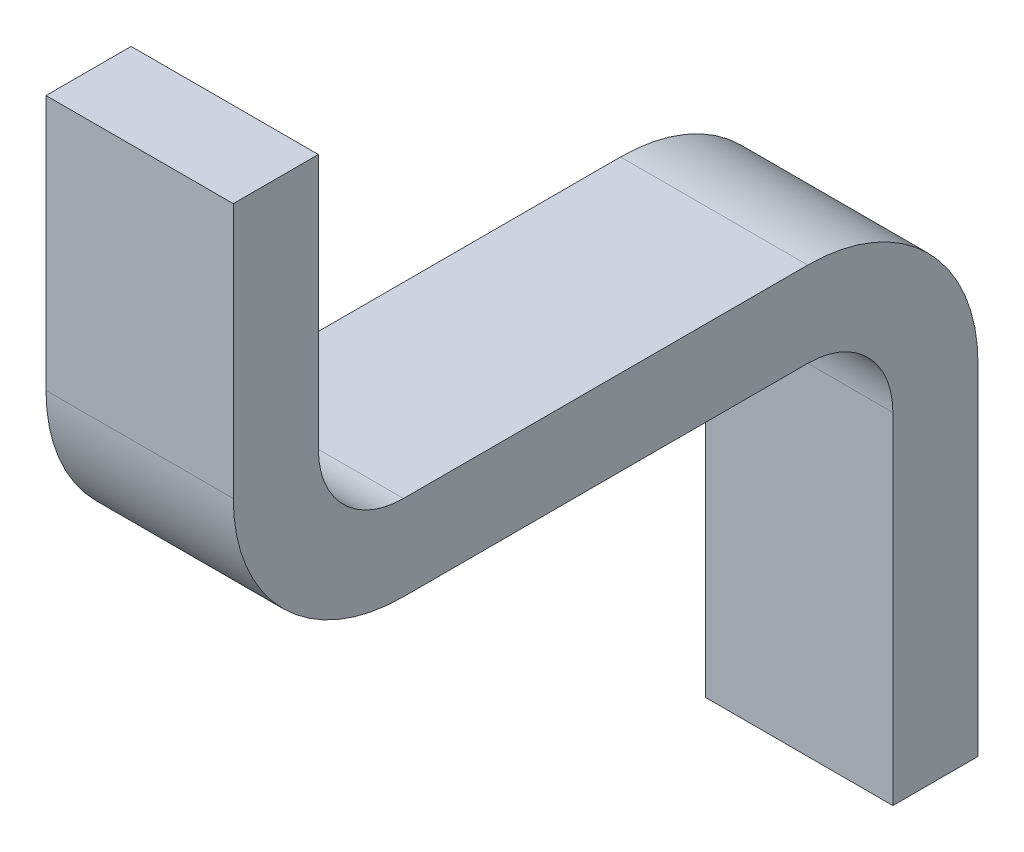
ISO-10303-21;
HEADER;
FILE_DESCRIPTION(('STEP AP214'),'2;1');
FILE_NAME('part.step','',(''),(''),'','','');
FILE_SCHEMA(('AUTOMOTIVE_DESIGN { 1 0 10303 214 1 1 1 1 }'));
ENDSEC;
DATA;
#1=APPLICATION_CONTEXT('core data for automotive mechanical design processes');
#2=APPLICATION_PROTOCOL_DEFINITION('international standard','automotive_design',2000,#1);
#3=PRODUCT_CONTEXT('',#1,'mechanical');
#4=PRODUCT('Part','Part','',(#3));
#5=PRODUCT_RELATED_PRODUCT_CATEGORY('part','',(#4));
#6=PRODUCT_DEFINITION_FORMATION('','',#4);
#7=PRODUCT_DEFINITION_CONTEXT('part definition',#1,'design');
#8=PRODUCT_DEFINITION('design','',#6,#7);
#9=PRODUCT_DEFINITION_SHAPE('','',#8);
#10=(LENGTH_UNIT() NAMED_UNIT(*) SI_UNIT(.MILLI.,.METRE.));
#11=(NAMED_UNIT(*) PLANE_ANGLE_UNIT() SI_UNIT($,.RADIAN.));
#12=(NAMED_UNIT(*) SI_UNIT($,.STERADIAN.) SOLID_ANGLE_UNIT());
#13=UNCERTAINTY_MEASURE_WITH_UNIT(LENGTH_MEASURE(1.E-05),#10,'distance_accuracy_value','');
#14=(GEOMETRIC_REPRESENTATION_CONTEXT(3) GLOBAL_UNCERTAINTY_ASSIGNED_CONTEXT((#13)) GLOBAL_UNIT_ASSIGNED_CONTEXT((#10,
#11,#12)) REPRESENTATION_CONTEXT('',''));
#15=CARTESIAN_POINT('',(0.,0.,0.));
#16=DIRECTION('',(0.,0.,1.));
#17=DIRECTION('',(1.,0.,0.));
#18=AXIS2_PLACEMENT_3D('',#15,#16,#17);
#19=CARTESIAN_POINT('',(0.14,-4.,0.675));
#20=DIRECTION('',(1.,0.,0.));
#21=DIRECTION('',(0.,1.,0.));
#22=AXIS2_PLACEMENT_3D('',#19,#20,#21);
#23=PLANE('',#22);
#24=CARTESIAN_POINT('',(0.14,-3.8,0.675));
#25=DIRECTION('',(-1.,0.,0.));
#26=DIRECTION('',(0.,-1.,0.));
#27=AXIS2_PLACEMENT_3D('',#24,#25,#26);
#28=CIRCLE('',#27,0.2);
#29=CARTESIAN_POINT('',(0.14,-3.8,0.875));
#30=VERTEX_POINT('',#29);
#31=CARTESIAN_POINT('',(0.14,-4.,0.675));
#32=VERTEX_POINT('',#31);
#33=EDGE_CURVE('E150',#30,#32,#28,.F.);
#34=ORIENTED_EDGE('',*,*,#33,.F.);
#35=DIRECTION('',(0.,1.,0.));
#36=VECTOR('',#35,1.);
#37=CARTESIAN_POINT('',(0.14,-3.5,0.875));
#38=LINE('',#37,#36);
#39=CARTESIAN_POINT('',(0.14,-3.5,0.875));
#40=VERTEX_POINT('',#39);
#41=EDGE_CURVE('E147',#30,#40,#38,.T.);
#42=ORIENTED_EDGE('',*,*,#41,.T.);
#43=DIRECTION('',(0.,0.,1.));
#44=VECTOR('',#43,1.);
#45=CARTESIAN_POINT('',(0.14,-3.5,0.775));
#46=LINE('',#45,#44);
#47=CARTESIAN_POINT('',(0.14,-3.5,0.775));
#48=VERTEX_POINT('',#47);
#49=EDGE_CURVE('E141',#48,#40,#46,.T.);
#50=ORIENTED_EDGE('',*,*,#49,.F.);
#51=DIRECTION('',(0.,1.,0.));
#52=VECTOR('',#51,1.);
#53=CARTESIAN_POINT('',(0.14,-3.5,0.775));
#54=LINE('',#53,#52);
#55=CARTESIAN_POINT('',(0.14,-3.8,0.775));
#56=VERTEX_POINT('',#55);
#57=EDGE_CURVE('E115',#48,#56,#54,.F.);
#58=ORIENTED_EDGE('',*,*,#57,.T.);
#59=CARTESIAN_POINT('',(0.14,-3.8,0.675));
#60=DIRECTION('',(-1.,0.,0.));
#61=DIRECTION('',(0.,-1.,0.));
#62=AXIS2_PLACEMENT_3D('',#59,#60,#61);
#63=CIRCLE('',#62,0.1);
#64=CARTESIAN_POINT('',(0.14,-3.9,0.675));
#65=VERTEX_POINT('',#64);
#66=EDGE_CURVE('E215',#56,#65,#63,.F.);
#67=ORIENTED_EDGE('',*,*,#66,.T.);
#68=DIRECTION('',(0.,0.,1.));
#69=VECTOR('',#68,1.);
#70=CARTESIAN_POINT('',(0.14,-3.9,0.675));
#71=LINE('',#70,#69);
#72=CARTESIAN_POINT('',(0.14,-3.9,0.2));
#73=VERTEX_POINT('',#72);
#74=EDGE_CURVE('E181',#65,#73,#71,.F.);
#75=ORIENTED_EDGE('',*,*,#74,.T.);
#76=CARTESIAN_POINT('',(0.14,-4.1,0.2));
#77=DIRECTION('',(1.,0.,0.));
#78=DIRECTION('',(0.,1.,0.));
#79=AXIS2_PLACEMENT_3D('',#76,#77,#78);
#80=CIRCLE('',#79,0.2);
#81=CARTESIAN_POINT('',(0.14,-4.1,0.));
#82=VERTEX_POINT('',#81);
#83=EDGE_CURVE('E20',#82,#73,#80,.T.);
#84=ORIENTED_EDGE('',*,*,#83,.F.);
#85=DIRECTION('',(0.,1.,0.));
#86=VECTOR('',#85,1.);
#87=CARTESIAN_POINT('',(0.14,-4.1,0.));
#88=LINE('',#87,#86);
#89=CARTESIAN_POINT('',(0.14,-4.5,0.));
#90=VERTEX_POINT('',#89);
#91=EDGE_CURVE('E91',#82,#90,#88,.F.);
#92=ORIENTED_EDGE('',*,*,#91,.T.);
#93=DIRECTION('',(0.,0.,1.));
#94=VECTOR('',#93,1.);
#95=CARTESIAN_POINT('',(0.14,-4.5,0.));
#96=LINE('',#95,#94);
#97=CARTESIAN_POINT('',(0.14,-4.5,0.1));
#98=VERTEX_POINT('',#97);
#99=EDGE_CURVE('E163',#90,#98,#96,.T.);
#100=ORIENTED_EDGE('',*,*,#99,.T.);
#101=DIRECTION('',(0.,1.,0.));
#102=VECTOR('',#101,1.);
#103=CARTESIAN_POINT('',(0.14,-4.1,0.1));
#104=LINE('',#103,#102);
#105=CARTESIAN_POINT('',(0.14,-4.1,0.1));
#106=VERTEX_POINT('',#105);
#107=EDGE_CURVE('E159',#98,#106,#104,.T.);
#108=ORIENTED_EDGE('',*,*,#107,.T.);
#109=CARTESIAN_POINT('',(0.14,-4.1,0.2));
#110=DIRECTION('',(1.,0.,0.));
#111=DIRECTION('',(0.,1.,0.));
#112=AXIS2_PLACEMENT_3D('',#109,#110,#111);
#113=CIRCLE('',#112,0.1);
#114=CARTESIAN_POINT('',(0.14,-4.,0.2));
#115=VERTEX_POINT('',#114);
#116=EDGE_CURVE('E155',#106,#115,#113,.T.);
#117=ORIENTED_EDGE('',*,*,#116,.T.);
#118=DIRECTION('',(0.,0.,1.));
#119=VECTOR('',#118,1.);
#120=CARTESIAN_POINT('',(0.14,-4.,0.675));
#121=LINE('',#120,#119);
#122=EDGE_CURVE('E154',#115,#32,#121,.T.);
#123=ORIENTED_EDGE('',*,*,#122,.T.);
#124=EDGE_LOOP('',(#34,#42,#50,#58,#67,#75,#84,#92,#100,#108,#117,#123));
#125=FACE_BOUND('',#124,.T.);
#126=ADVANCED_FACE('F17',(#125),#23,.F.);
#127=CARTESIAN_POINT('',(0.14,-4.1,0.2));
#128=DIRECTION('',(1.,0.,0.));
#129=DIRECTION('',(0.,1.,0.));
#130=AXIS2_PLACEMENT_3D('',#127,#128,#129);
#131=CYLINDRICAL_SURFACE('',#130,0.2);
#132=CARTESIAN_POINT('',(0.36,-4.1,0.2));
#133=DIRECTION('',(1.,0.,0.));
#134=DIRECTION('',(0.,1.,0.));
#135=AXIS2_PLACEMENT_3D('',#132,#133,#134);
#136=CIRCLE('',#135,0.2);
#137=CARTESIAN_POINT('',(0.36,-3.9,0.2));
#138=VERTEX_POINT('',#137);
#139=CARTESIAN_POINT('',(0.36,-4.1,0.));
#140=VERTEX_POINT('',#139);
#141=EDGE_CURVE('E183',#138,#140,#136,.F.);
#142=ORIENTED_EDGE('',*,*,#141,.T.);
#143=DIRECTION('',(1.,0.,0.));
#144=VECTOR('',#143,1.);
#145=CARTESIAN_POINT('',(0.14,-4.1,0.));
#146=LINE('',#145,#144);
#147=EDGE_CURVE('E178',#140,#82,#146,.F.);
#148=ORIENTED_EDGE('',*,*,#147,.T.);
#149=ORIENTED_EDGE('',*,*,#83,.T.);
#150=DIRECTION('',(1.,0.,0.));
#151=VECTOR('',#150,1.);
#152=CARTESIAN_POINT('',(0.14,-3.9,0.2));
#153=LINE('',#152,#151);
#154=EDGE_CURVE('E217',#73,#138,#153,.T.);
#155=ORIENTED_EDGE('',*,*,#154,.T.);
#156=EDGE_LOOP('',(#142,#148,#149,#155));
#157=FACE_BOUND('',#156,.T.);
#158=ADVANCED_FACE('F254',(#157),#131,.T.);
#159=CARTESIAN_POINT('',(0.14,-4.1,0.));
#160=DIRECTION('',(0.,0.,1.));
#161=DIRECTION('',(1.,0.,0.));
#162=AXIS2_PLACEMENT_3D('',#159,#160,#161);
#163=PLANE('',#162);
#164=ORIENTED_EDGE('',*,*,#147,.F.);
#165=DIRECTION('',(0.,-1.,0.));
#166=VECTOR('',#165,1.);
#167=CARTESIAN_POINT('',(0.36,-3.9,0.));
#168=LINE('',#167,#166);
#169=CARTESIAN_POINT('',(0.36,-4.5,0.));
#170=VERTEX_POINT('',#169);
#171=EDGE_CURVE('E170',#140,#170,#168,.T.);
#172=ORIENTED_EDGE('',*,*,#171,.T.);
#173=DIRECTION('',(-1.,0.,0.));
#174=VECTOR('',#173,1.);
#175=CARTESIAN_POINT('',(0.14,-4.5,0.));
#176=LINE('',#175,#174);
#177=EDGE_CURVE('E173',#170,#90,#176,.T.);
#178=ORIENTED_EDGE('',*,*,#177,.T.);
#179=ORIENTED_EDGE('',*,*,#91,.F.);
#180=EDGE_LOOP('',(#164,#172,#178,#179));
#181=FACE_BOUND('',#180,.T.);
#182=ADVANCED_FACE('F257',(#181),#163,.F.);
#183=CARTESIAN_POINT('',(0.14,-4.5,0.));
#184=DIRECTION('',(0.,1.,0.));
#185=DIRECTION('',(-1.,0.,0.));
#186=AXIS2_PLACEMENT_3D('',#183,#184,#185);
#187=PLANE('',#186);
#188=DIRECTION('',(-1.,0.,0.));
#189=VECTOR('',#188,1.);
#190=CARTESIAN_POINT('',(0.36,-4.5,0.1));
#191=LINE('',#190,#189);
#192=CARTESIAN_POINT('',(0.36,-4.5,0.1));
#193=VERTEX_POINT('',#192);
#194=EDGE_CURVE('E160',#193,#98,#191,.T.);
#195=ORIENTED_EDGE('',*,*,#194,.T.);
#196=ORIENTED_EDGE('',*,*,#99,.F.);
#197=ORIENTED_EDGE('',*,*,#177,.F.);
#198=DIRECTION('',(0.,0.,1.));
#199=VECTOR('',#198,1.);
#200=CARTESIAN_POINT('',(0.36,-4.5,0.675));
#201=LINE('',#200,#199);
#202=EDGE_CURVE('E166',#170,#193,#201,.T.);
#203=ORIENTED_EDGE('',*,*,#202,.T.);
#204=EDGE_LOOP('',(#195,#196,#197,#203));
#205=FACE_BOUND('',#204,.T.);
#206=ADVANCED_FACE('F259',(#205),#187,.F.);
#207=CARTESIAN_POINT('',(0.36,-4.1,0.1));
#208=DIRECTION('',(0.,0.,-1.));
#209=DIRECTION('',(-1.,0.,0.));
#210=AXIS2_PLACEMENT_3D('',#207,#208,#209);
#211=PLANE('',#210);
#212=DIRECTION('',(1.,0.,0.));
#213=VECTOR('',#212,1.);
#214=CARTESIAN_POINT('',(0.36,-4.1,0.1));
#215=LINE('',#214,#213);
#216=CARTESIAN_POINT('',(0.36,-4.1,0.1));
#217=VERTEX_POINT('',#216);
#218=EDGE_CURVE('E156',#217,#106,#215,.F.);
#219=ORIENTED_EDGE('',*,*,#218,.T.);
#220=ORIENTED_EDGE('',*,*,#107,.F.);
#221=ORIENTED_EDGE('',*,*,#194,.F.);
#222=DIRECTION('',(0.,-1.,0.));
#223=VECTOR('',#222,1.);
#224=CARTESIAN_POINT('',(0.36,-3.9,0.1));
#225=LINE('',#224,#223);
#226=EDGE_CURVE('E169',#193,#217,#225,.F.);
#227=ORIENTED_EDGE('',*,*,#226,.T.);
#228=EDGE_LOOP('',(#219,#220,#221,#227));
#229=FACE_BOUND('',#228,.T.);
#230=ADVANCED_FACE('F234',(#229),#211,.F.);
#231=CARTESIAN_POINT('',(0.36,-4.1,0.2));
#232=DIRECTION('',(1.,0.,0.));
#233=DIRECTION('',(0.,1.,0.));
#234=AXIS2_PLACEMENT_3D('',#231,#232,#233);
#235=CYLINDRICAL_SURFACE('',#234,0.1);
#236=DIRECTION('',(-1.,0.,0.));
#237=VECTOR('',#236,1.);
#238=CARTESIAN_POINT('',(0.36,-4.,0.2));
#239=LINE('',#238,#237);
#240=CARTESIAN_POINT('',(0.36,-4.,0.2));
#241=VERTEX_POINT('',#240);
#242=EDGE_CURVE('E151',#241,#115,#239,.T.);
#243=ORIENTED_EDGE('',*,*,#242,.T.);
#244=ORIENTED_EDGE('',*,*,#116,.F.);
#245=ORIENTED_EDGE('',*,*,#218,.F.);
#246=CARTESIAN_POINT('',(0.36,-4.1,0.2));
#247=DIRECTION('',(1.,0.,0.));
#248=DIRECTION('',(0.,1.,0.));
#249=AXIS2_PLACEMENT_3D('',#246,#247,#248);
#250=CIRCLE('',#249,0.1);
#251=EDGE_CURVE('E210',#217,#241,#250,.T.);
#252=ORIENTED_EDGE('',*,*,#251,.T.);
#253=EDGE_LOOP('',(#243,#244,#245,#252));
#254=FACE_BOUND('',#253,.T.);
#255=ADVANCED_FACE('F227',(#254),#235,.F.);
#256=CARTESIAN_POINT('',(0.36,-4.,0.675));
#257=DIRECTION('',(0.,1.,0.));
#258=DIRECTION('',(-1.,0.,0.));
#259=AXIS2_PLACEMENT_3D('',#256,#257,#258);
#260=PLANE('',#259);
#261=DIRECTION('',(-1.,0.,0.));
#262=VECTOR('',#261,1.);
#263=CARTESIAN_POINT('',(0.36,-4.,0.675));
#264=LINE('',#263,#262);
#265=CARTESIAN_POINT('',(0.36,-4.,0.675));
#266=VERTEX_POINT('',#265);
#267=EDGE_CURVE('E148',#32,#266,#264,.F.);
#268=ORIENTED_EDGE('',*,*,#267,.F.);
#269=ORIENTED_EDGE('',*,*,#122,.F.);
#270=ORIENTED_EDGE('',*,*,#242,.F.);
#271=DIRECTION('',(0.,0.,1.));
#272=VECTOR('',#271,1.);
#273=CARTESIAN_POINT('',(0.36,-4.,0.675));
#274=LINE('',#273,#272);
#275=EDGE_CURVE('E209',#241,#266,#274,.T.);
#276=ORIENTED_EDGE('',*,*,#275,.T.);
#277=EDGE_LOOP('',(#268,#269,#270,#276));
#278=FACE_BOUND('',#277,.T.);
#279=ADVANCED_FACE('F224',(#278),#260,.F.);
#280=CARTESIAN_POINT('',(0.36,-3.8,0.675));
#281=DIRECTION('',(-1.,0.,0.));
#282=DIRECTION('',(0.,-1.,0.));
#283=AXIS2_PLACEMENT_3D('',#280,#281,#282);
#284=CYLINDRICAL_SURFACE('',#283,0.2);
#285=ORIENTED_EDGE('',*,*,#33,.T.);
#286=ORIENTED_EDGE('',*,*,#267,.T.);
#287=CARTESIAN_POINT('',(0.36,-3.8,0.675));
#288=DIRECTION('',(-1.,0.,0.));
#289=DIRECTION('',(0.,-1.,0.));
#290=AXIS2_PLACEMENT_3D('',#287,#288,#289);
#291=CIRCLE('',#290,0.2);
#292=CARTESIAN_POINT('',(0.36,-3.8,0.875));
#293=VERTEX_POINT('',#292);
#294=EDGE_CURVE('E133',#266,#293,#291,.T.);
#295=ORIENTED_EDGE('',*,*,#294,.T.);
#296=DIRECTION('',(-1.,0.,0.));
#297=VECTOR('',#296,1.);
#298=CARTESIAN_POINT('',(0.36,-3.8,0.875));
#299=LINE('',#298,#297);
#300=EDGE_CURVE('E144',#293,#30,#299,.T.);
#301=ORIENTED_EDGE('',*,*,#300,.T.);
#302=EDGE_LOOP('',(#285,#286,#295,#301));
#303=FACE_BOUND('',#302,.T.);
#304=ADVANCED_FACE('F285',(#303),#284,.T.);
#305=CARTESIAN_POINT('',(0.36,-3.5,0.875));
#306=DIRECTION('',(0.,0.,-1.));
#307=DIRECTION('',(-1.,0.,0.));
#308=AXIS2_PLACEMENT_3D('',#305,#306,#307);
#309=PLANE('',#308);
#310=DIRECTION('',(-1.,0.,0.));
#311=VECTOR('',#310,1.);
#312=CARTESIAN_POINT('',(0.14,-3.5,0.875));
#313=LINE('',#312,#311);
#314=CARTESIAN_POINT('',(0.36,-3.5,0.875));
#315=VERTEX_POINT('',#314);
#316=EDGE_CURVE('E118',#40,#315,#313,.F.);
#317=ORIENTED_EDGE('',*,*,#316,.F.);
#318=ORIENTED_EDGE('',*,*,#41,.F.);
#319=ORIENTED_EDGE('',*,*,#300,.F.);
#320=DIRECTION('',(0.,-1.,0.));
#321=VECTOR('',#320,1.);
#322=CARTESIAN_POINT('',(0.36,-3.9,0.875));
#323=LINE('',#322,#321);
#324=EDGE_CURVE('E131',#293,#315,#323,.F.);
#325=ORIENTED_EDGE('',*,*,#324,.T.);
#326=EDGE_LOOP('',(#317,#318,#319,#325));
#327=FACE_BOUND('',#326,.T.);
#328=ADVANCED_FACE('F282',(#327),#309,.F.);
#329=CARTESIAN_POINT('',(0.14,-3.5,0.775));
#330=DIRECTION('',(0.,1.,0.));
#331=DIRECTION('',(-1.,0.,0.));
#332=AXIS2_PLACEMENT_3D('',#329,#330,#331);
#333=PLANE('',#332);
#334=ORIENTED_EDGE('',*,*,#49,.T.);
#335=ORIENTED_EDGE('',*,*,#316,.T.);
#336=DIRECTION('',(0.,0.,1.));
#337=VECTOR('',#336,1.);
#338=CARTESIAN_POINT('',(0.36,-3.5,0.675));
#339=LINE('',#338,#337);
#340=CARTESIAN_POINT('',(0.36,-3.5,0.775));
#341=VERTEX_POINT('',#340);
#342=EDGE_CURVE('E125',#315,#341,#339,.F.);
#343=ORIENTED_EDGE('',*,*,#342,.T.);
#344=DIRECTION('',(1.,0.,0.));
#345=VECTOR('',#344,1.);
#346=CARTESIAN_POINT('',(0.14,-3.5,0.775));
#347=LINE('',#346,#345);
#348=EDGE_CURVE('E110',#341,#48,#347,.F.);
#349=ORIENTED_EDGE('',*,*,#348,.T.);
#350=EDGE_LOOP('',(#334,#335,#343,#349));
#351=FACE_BOUND('',#350,.T.);
#352=ADVANCED_FACE('F129',(#351),#333,.T.);
#353=CARTESIAN_POINT('',(0.14,-3.5,0.775));
#354=DIRECTION('',(0.,0.,1.));
#355=DIRECTION('',(1.,0.,0.));
#356=AXIS2_PLACEMENT_3D('',#353,#354,#355);
#357=PLANE('',#356);
#358=ORIENTED_EDGE('',*,*,#348,.F.);
#359=DIRECTION('',(0.,-1.,0.));
#360=VECTOR('',#359,1.);
#361=CARTESIAN_POINT('',(0.36,-3.9,0.775));
#362=LINE('',#361,#360);
#363=CARTESIAN_POINT('',(0.36,-3.8,0.775));
#364=VERTEX_POINT('',#363);
#365=EDGE_CURVE('E114',#341,#364,#362,.T.);
#366=ORIENTED_EDGE('',*,*,#365,.T.);
#367=DIRECTION('',(-1.,0.,0.));
#368=VECTOR('',#367,1.);
#369=CARTESIAN_POINT('',(0.14,-3.8,0.775));
#370=LINE('',#369,#368);
#371=EDGE_CURVE('E185',#364,#56,#370,.T.);
#372=ORIENTED_EDGE('',*,*,#371,.T.);
#373=ORIENTED_EDGE('',*,*,#57,.F.);
#374=EDGE_LOOP('',(#358,#366,#372,#373));
#375=FACE_BOUND('',#374,.T.);
#376=ADVANCED_FACE('F112',(#375),#357,.F.);
#377=CARTESIAN_POINT('',(0.14,-3.8,0.675));
#378=DIRECTION('',(-1.,0.,0.));
#379=DIRECTION('',(0.,-1.,0.));
#380=AXIS2_PLACEMENT_3D('',#377,#378,#379);
#381=CYLINDRICAL_SURFACE('',#380,0.1);
#382=ORIENTED_EDGE('',*,*,#371,.F.);
#383=CARTESIAN_POINT('',(0.36,-3.8,0.675));
#384=DIRECTION('',(-1.,0.,0.));
#385=DIRECTION('',(0.,-1.,0.));
#386=AXIS2_PLACEMENT_3D('',#383,#384,#385);
#387=CIRCLE('',#386,0.1);
#388=CARTESIAN_POINT('',(0.36,-3.9,0.675));
#389=VERTEX_POINT('',#388);
#390=EDGE_CURVE('E26',#364,#389,#387,.F.);
#391=ORIENTED_EDGE('',*,*,#390,.T.);
#392=DIRECTION('',(1.,0.,0.));
#393=VECTOR('',#392,1.);
#394=CARTESIAN_POINT('',(0.14,-3.9,0.675));
#395=LINE('',#394,#393);
#396=EDGE_CURVE('E34',#389,#65,#395,.F.);
#397=ORIENTED_EDGE('',*,*,#396,.T.);
#398=ORIENTED_EDGE('',*,*,#66,.F.);
#399=EDGE_LOOP('',(#382,#391,#397,#398));
#400=FACE_BOUND('',#399,.T.);
#401=ADVANCED_FACE('F250',(#400),#381,.F.);
#402=CARTESIAN_POINT('',(0.14,-3.9,0.675));
#403=DIRECTION('',(0.,-1.,0.));
#404=DIRECTION('',(1.,0.,0.));
#405=AXIS2_PLACEMENT_3D('',#402,#403,#404);
#406=PLANE('',#405);
#407=ORIENTED_EDGE('',*,*,#396,.F.);
#408=DIRECTION('',(0.,0.,1.));
#409=VECTOR('',#408,1.);
#410=CARTESIAN_POINT('',(0.36,-3.9,0.675));
#411=LINE('',#410,#409);
#412=EDGE_CURVE('E11',#389,#138,#411,.F.);
#413=ORIENTED_EDGE('',*,*,#412,.T.);
#414=ORIENTED_EDGE('',*,*,#154,.F.);
#415=ORIENTED_EDGE('',*,*,#74,.F.);
#416=EDGE_LOOP('',(#407,#413,#414,#415));
#417=FACE_BOUND('',#416,.T.);
#418=ADVANCED_FACE('F252',(#417),#406,.F.);
#419=CARTESIAN_POINT('',(0.36,-3.9,0.675));
#420=DIRECTION('',(-1.,0.,0.));
#421=DIRECTION('',(0.,-1.,0.));
#422=AXIS2_PLACEMENT_3D('',#419,#420,#421);
#423=PLANE('',#422);
#424=ORIENTED_EDGE('',*,*,#390,.F.);
#425=ORIENTED_EDGE('',*,*,#365,.F.);
#426=ORIENTED_EDGE('',*,*,#342,.F.);
#427=ORIENTED_EDGE('',*,*,#324,.F.);
#428=ORIENTED_EDGE('',*,*,#294,.F.);
#429=ORIENTED_EDGE('',*,*,#275,.F.);
#430=ORIENTED_EDGE('',*,*,#251,.F.);
#431=ORIENTED_EDGE('',*,*,#226,.F.);
#432=ORIENTED_EDGE('',*,*,#202,.F.);
#433=ORIENTED_EDGE('',*,*,#171,.F.);
#434=ORIENTED_EDGE('',*,*,#141,.F.);
#435=ORIENTED_EDGE('',*,*,#412,.F.);
#436=EDGE_LOOP('',(#424,#425,#426,#427,#428,#429,#430,#431,#432,#433,#434,#435));
#437=FACE_BOUND('',#436,.T.);
#438=ADVANCED_FACE('F123',(#437),#423,.F.);
#439=CLOSED_SHELL('',(#126,#158,#182,#206,#230,#255,#279,#304,#328,#352,#376,#401,#418,#438));
#440=MANIFOLD_SOLID_BREP('B1',#439);
#441=ADVANCED_BREP_SHAPE_REPRESENTATION('',(#18,#440),#14);
#442=SHAPE_DEFINITION_REPRESENTATION(#9,#441);
ENDSEC;
END-ISO-10303-21;
